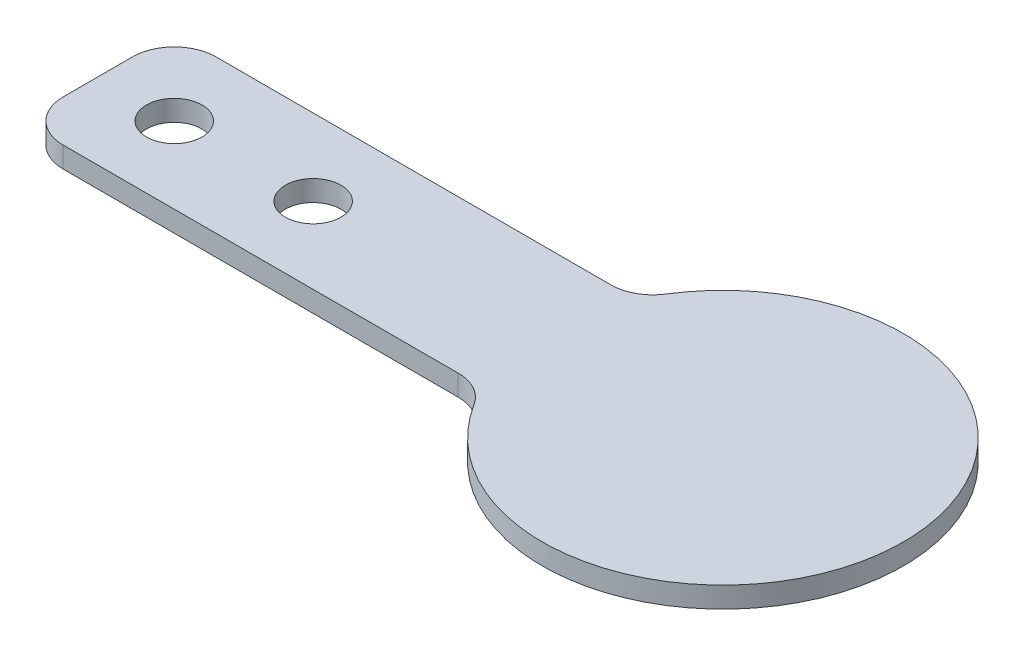
ISO-10303-21;
HEADER;
FILE_DESCRIPTION(('STEP AP214'),'2;1');
FILE_NAME('part.step','',(''),(''),'','','');
FILE_SCHEMA(('AUTOMOTIVE_DESIGN { 1 0 10303 214 1 1 1 1 }'));
ENDSEC;
DATA;
#1=APPLICATION_CONTEXT('core data for automotive mechanical design processes');
#2=APPLICATION_PROTOCOL_DEFINITION('international standard','automotive_design',2000,#1);
#3=PRODUCT_CONTEXT('',#1,'mechanical');
#4=PRODUCT('Part','Part','',(#3));
#5=PRODUCT_RELATED_PRODUCT_CATEGORY('part','',(#4));
#6=PRODUCT_DEFINITION_FORMATION('','',#4);
#7=PRODUCT_DEFINITION_CONTEXT('part definition',#1,'design');
#8=PRODUCT_DEFINITION('design','',#6,#7);
#9=PRODUCT_DEFINITION_SHAPE('','',#8);
#10=(LENGTH_UNIT() NAMED_UNIT(*) SI_UNIT(.MILLI.,.METRE.));
#11=(NAMED_UNIT(*) PLANE_ANGLE_UNIT() SI_UNIT($,.RADIAN.));
#12=(NAMED_UNIT(*) SI_UNIT($,.STERADIAN.) SOLID_ANGLE_UNIT());
#13=UNCERTAINTY_MEASURE_WITH_UNIT(LENGTH_MEASURE(1.E-05),#10,'distance_accuracy_value','');
#14=(GEOMETRIC_REPRESENTATION_CONTEXT(3) GLOBAL_UNCERTAINTY_ASSIGNED_CONTEXT((#13)) GLOBAL_UNIT_ASSIGNED_CONTEXT((#10,
#11,#12)) REPRESENTATION_CONTEXT('',''));
#15=CARTESIAN_POINT('',(0.,0.,0.));
#16=DIRECTION('',(0.,0.,1.));
#17=DIRECTION('',(1.,0.,0.));
#18=AXIS2_PLACEMENT_3D('',#15,#16,#17);
#19=CARTESIAN_POINT('',(3.,1.5,8.));
#20=DIRECTION('',(0.,1.,0.));
#21=DIRECTION('',(0.,0.,1.));
#22=AXIS2_PLACEMENT_3D('',#19,#20,#21);
#23=PLANE('',#22);
#24=CARTESIAN_POINT('',(5.5,1.5,5.5));
#25=DIRECTION('',(0.,1.,0.));
#26=DIRECTION('',(0.,0.,1.));
#27=AXIS2_PLACEMENT_3D('',#24,#25,#26);
#28=CIRCLE('',#27,2.);
#29=CARTESIAN_POINT('',(5.5,1.5,7.5));
#30=VERTEX_POINT('',#29);
#31=EDGE_CURVE('E134',#30,#30,#28,.T.);
#32=ORIENTED_EDGE('',*,*,#31,.F.);
#33=EDGE_LOOP('',(#32));
#34=FACE_BOUND('',#33,.T.);
#35=CARTESIAN_POINT('',(3.,1.5,8.));
#36=DIRECTION('',(0.,1.,0.));
#37=DIRECTION('',(0.,0.,1.));
#38=AXIS2_PLACEMENT_3D('',#35,#36,#37);
#39=CIRCLE('',#38,3.);
#40=CARTESIAN_POINT('',(0.,1.5,7.99999999999998));
#41=VERTEX_POINT('',#40);
#42=CARTESIAN_POINT('',(3.00000000000002,1.5,11.));
#43=VERTEX_POINT('',#42);
#44=EDGE_CURVE('E145',#41,#43,#39,.T.);
#45=ORIENTED_EDGE('',*,*,#44,.T.);
#46=DIRECTION('',(1.,0.,0.));
#47=VECTOR('',#46,1.);
#48=CARTESIAN_POINT('',(3.00000000000002,1.5,11.));
#49=LINE('',#48,#47);
#50=CARTESIAN_POINT('',(31.444558288274,1.5,11.));
#51=VERTEX_POINT('',#50);
#52=EDGE_CURVE('E93',#43,#51,#49,.T.);
#53=ORIENTED_EDGE('',*,*,#52,.T.);
#54=CARTESIAN_POINT('',(31.444558288274,1.5,14.));
#55=DIRECTION('',(0.,-1.,0.));
#56=DIRECTION('',(0.,0.,-1.));
#57=AXIS2_PLACEMENT_3D('',#54,#55,#56);
#58=CIRCLE('',#57,3.);
#59=CARTESIAN_POINT('',(33.9862036092226,1.5,12.40625));
#60=VERTEX_POINT('',#59);
#61=EDGE_CURVE('E160',#51,#60,#58,.T.);
#62=ORIENTED_EDGE('',*,*,#61,.T.);
#63=CARTESIAN_POINT('',(45.,1.5,5.49999999999999));
#64=DIRECTION('',(0.,1.,0.));
#65=DIRECTION('',(0.,0.,1.));
#66=AXIS2_PLACEMENT_3D('',#63,#64,#65);
#67=CIRCLE('',#66,13.);
#68=CARTESIAN_POINT('',(33.9862036092227,1.5,-1.40625000000001));
#69=VERTEX_POINT('',#68);
#70=EDGE_CURVE('E173',#60,#69,#67,.T.);
#71=ORIENTED_EDGE('',*,*,#70,.T.);
#72=CARTESIAN_POINT('',(31.444558288274,1.5,-3.00000000000001));
#73=DIRECTION('',(0.,-1.,0.));
#74=DIRECTION('',(0.,0.,1.));
#75=AXIS2_PLACEMENT_3D('',#72,#73,#74);
#76=CIRCLE('',#75,3.);
#77=CARTESIAN_POINT('',(31.444558288274,1.5,0.));
#78=VERTEX_POINT('',#77);
#79=EDGE_CURVE('E112',#69,#78,#76,.T.);
#80=ORIENTED_EDGE('',*,*,#79,.T.);
#81=DIRECTION('',(-1.,0.,0.));
#82=VECTOR('',#81,1.);
#83=CARTESIAN_POINT('',(3.00000000000002,1.5,0.));
#84=LINE('',#83,#82);
#85=CARTESIAN_POINT('',(3.00000000000002,1.5,0.));
#86=VERTEX_POINT('',#85);
#87=EDGE_CURVE('E106',#78,#86,#84,.T.);
#88=ORIENTED_EDGE('',*,*,#87,.T.);
#89=CARTESIAN_POINT('',(3.,1.5,3.));
#90=DIRECTION('',(0.,1.,0.));
#91=DIRECTION('',(0.,0.,1.));
#92=AXIS2_PLACEMENT_3D('',#89,#90,#91);
#93=CIRCLE('',#92,3.);
#94=CARTESIAN_POINT('',(0.,1.5,3.00000000000002));
#95=VERTEX_POINT('',#94);
#96=EDGE_CURVE('E110',#86,#95,#93,.T.);
#97=ORIENTED_EDGE('',*,*,#96,.T.);
#98=DIRECTION('',(0.,0.,1.));
#99=VECTOR('',#98,1.);
#100=CARTESIAN_POINT('',(0.,1.5,3.00000000000002));
#101=LINE('',#100,#99);
#102=EDGE_CURVE('E50',#95,#41,#101,.T.);
#103=ORIENTED_EDGE('',*,*,#102,.T.);
#104=EDGE_LOOP('',(#45,#53,#62,#71,#80,#88,#97,#103));
#105=FACE_BOUND('',#104,.T.);
#106=CARTESIAN_POINT('',(15.5,1.5,5.5));
#107=DIRECTION('',(0.,1.,0.));
#108=DIRECTION('',(0.,0.,1.));
#109=AXIS2_PLACEMENT_3D('',#106,#107,#108);
#110=CIRCLE('',#109,2.);
#111=CARTESIAN_POINT('',(15.5,1.5,7.5));
#112=VERTEX_POINT('',#111);
#113=EDGE_CURVE('E182',#112,#112,#110,.T.);
#114=ORIENTED_EDGE('',*,*,#113,.F.);
#115=EDGE_LOOP('',(#114));
#116=FACE_BOUND('',#115,.T.);
#117=ADVANCED_FACE('F33',(#34,#105,#116),#23,.T.);
#118=CARTESIAN_POINT('',(3.,0.,8.));
#119=DIRECTION('',(0.,1.,0.));
#120=DIRECTION('',(0.,0.,1.));
#121=AXIS2_PLACEMENT_3D('',#118,#119,#120);
#122=PLANE('',#121);
#123=CARTESIAN_POINT('',(5.5,0.,5.5));
#124=DIRECTION('',(0.,1.,0.));
#125=DIRECTION('',(0.,0.,1.));
#126=AXIS2_PLACEMENT_3D('',#123,#124,#125);
#127=CIRCLE('',#126,2.);
#128=CARTESIAN_POINT('',(5.5,0.,7.5));
#129=VERTEX_POINT('',#128);
#130=EDGE_CURVE('E179',#129,#129,#127,.T.);
#131=ORIENTED_EDGE('',*,*,#130,.T.);
#132=EDGE_LOOP('',(#131));
#133=FACE_BOUND('',#132,.T.);
#134=CARTESIAN_POINT('',(3.,0.,8.));
#135=DIRECTION('',(0.,1.,0.));
#136=DIRECTION('',(0.,0.,1.));
#137=AXIS2_PLACEMENT_3D('',#134,#135,#136);
#138=CIRCLE('',#137,3.);
#139=CARTESIAN_POINT('',(0.,0.,7.99999999999998));
#140=VERTEX_POINT('',#139);
#141=CARTESIAN_POINT('',(3.00000000000002,0.,11.));
#142=VERTEX_POINT('',#141);
#143=EDGE_CURVE('E130',#140,#142,#138,.T.);
#144=ORIENTED_EDGE('',*,*,#143,.F.);
#145=DIRECTION('',(0.,0.,1.));
#146=VECTOR('',#145,1.);
#147=CARTESIAN_POINT('',(0.,0.,3.00000000000002));
#148=LINE('',#147,#146);
#149=CARTESIAN_POINT('',(0.,0.,3.00000000000002));
#150=VERTEX_POINT('',#149);
#151=EDGE_CURVE('E85',#150,#140,#148,.T.);
#152=ORIENTED_EDGE('',*,*,#151,.F.);
#153=CARTESIAN_POINT('',(3.,0.,3.));
#154=DIRECTION('',(0.,1.,0.));
#155=DIRECTION('',(0.,0.,1.));
#156=AXIS2_PLACEMENT_3D('',#153,#154,#155);
#157=CIRCLE('',#156,3.);
#158=CARTESIAN_POINT('',(3.00000000000002,0.,0.));
#159=VERTEX_POINT('',#158);
#160=EDGE_CURVE('E79',#159,#150,#157,.T.);
#161=ORIENTED_EDGE('',*,*,#160,.F.);
#162=DIRECTION('',(-1.,0.,0.));
#163=VECTOR('',#162,1.);
#164=CARTESIAN_POINT('',(3.00000000000002,0.,0.));
#165=LINE('',#164,#163);
#166=CARTESIAN_POINT('',(31.444558288274,0.,0.));
#167=VERTEX_POINT('',#166);
#168=EDGE_CURVE('E120',#167,#159,#165,.T.);
#169=ORIENTED_EDGE('',*,*,#168,.F.);
#170=CARTESIAN_POINT('',(31.444558288274,0.,-3.00000000000001));
#171=DIRECTION('',(0.,-1.,0.));
#172=DIRECTION('',(0.,0.,1.));
#173=AXIS2_PLACEMENT_3D('',#170,#171,#172);
#174=CIRCLE('',#173,3.);
#175=CARTESIAN_POINT('',(33.9862036092227,0.,-1.40625000000001));
#176=VERTEX_POINT('',#175);
#177=EDGE_CURVE('E140',#176,#167,#174,.T.);
#178=ORIENTED_EDGE('',*,*,#177,.F.);
#179=CARTESIAN_POINT('',(45.,0.,5.49999999999999));
#180=DIRECTION('',(0.,1.,0.));
#181=DIRECTION('',(0.,0.,1.));
#182=AXIS2_PLACEMENT_3D('',#179,#180,#181);
#183=CIRCLE('',#182,13.);
#184=CARTESIAN_POINT('',(33.9862036092226,0.,12.40625));
#185=VERTEX_POINT('',#184);
#186=EDGE_CURVE('E138',#185,#176,#183,.T.);
#187=ORIENTED_EDGE('',*,*,#186,.F.);
#188=CARTESIAN_POINT('',(31.444558288274,0.,14.));
#189=DIRECTION('',(0.,-1.,0.));
#190=DIRECTION('',(0.,0.,-1.));
#191=AXIS2_PLACEMENT_3D('',#188,#189,#190);
#192=CIRCLE('',#191,3.);
#193=CARTESIAN_POINT('',(31.444558288274,0.,11.));
#194=VERTEX_POINT('',#193);
#195=EDGE_CURVE('E136',#194,#185,#192,.T.);
#196=ORIENTED_EDGE('',*,*,#195,.F.);
#197=DIRECTION('',(1.,0.,0.));
#198=VECTOR('',#197,1.);
#199=CARTESIAN_POINT('',(3.00000000000002,0.,11.));
#200=LINE('',#199,#198);
#201=EDGE_CURVE('E133',#142,#194,#200,.T.);
#202=ORIENTED_EDGE('',*,*,#201,.F.);
#203=EDGE_LOOP('',(#144,#152,#161,#169,#178,#187,#196,#202));
#204=FACE_BOUND('',#203,.T.);
#205=CARTESIAN_POINT('',(15.5,0.,5.5));
#206=DIRECTION('',(0.,1.,0.));
#207=DIRECTION('',(0.,0.,1.));
#208=AXIS2_PLACEMENT_3D('',#205,#206,#207);
#209=CIRCLE('',#208,2.);
#210=CARTESIAN_POINT('',(15.5,0.,7.5));
#211=VERTEX_POINT('',#210);
#212=EDGE_CURVE('E185',#211,#211,#209,.T.);
#213=ORIENTED_EDGE('',*,*,#212,.T.);
#214=EDGE_LOOP('',(#213));
#215=FACE_BOUND('',#214,.T.);
#216=ADVANCED_FACE('F164',(#133,#204,#215),#122,.F.);
#217=CARTESIAN_POINT('',(3.,1.5,8.));
#218=DIRECTION('',(0.,-1.,0.));
#219=DIRECTION('',(0.,0.,-1.));
#220=AXIS2_PLACEMENT_3D('',#217,#218,#219);
#221=CYLINDRICAL_SURFACE('',#220,3.);
#222=ORIENTED_EDGE('',*,*,#143,.T.);
#223=DIRECTION('',(0.,-1.,0.));
#224=VECTOR('',#223,1.);
#225=CARTESIAN_POINT('',(3.00000000000002,1.5,11.));
#226=LINE('',#225,#224);
#227=EDGE_CURVE('E11',#43,#142,#226,.T.);
#228=ORIENTED_EDGE('',*,*,#227,.F.);
#229=ORIENTED_EDGE('',*,*,#44,.F.);
#230=DIRECTION('',(0.,-1.,0.));
#231=VECTOR('',#230,1.);
#232=CARTESIAN_POINT('',(0.,1.5,7.99999999999998));
#233=LINE('',#232,#231);
#234=EDGE_CURVE('E126',#41,#140,#233,.T.);
#235=ORIENTED_EDGE('',*,*,#234,.T.);
#236=EDGE_LOOP('',(#222,#228,#229,#235));
#237=FACE_BOUND('',#236,.T.);
#238=ADVANCED_FACE('F35',(#237),#221,.T.);
#239=CARTESIAN_POINT('',(3.00000000000002,1.5,11.));
#240=DIRECTION('',(0.,0.,-1.));
#241=DIRECTION('',(-1.,0.,0.));
#242=AXIS2_PLACEMENT_3D('',#239,#240,#241);
#243=PLANE('',#242);
#244=ORIENTED_EDGE('',*,*,#201,.T.);
#245=DIRECTION('',(0.,-1.,0.));
#246=VECTOR('',#245,1.);
#247=CARTESIAN_POINT('',(31.444558288274,1.5,11.));
#248=LINE('',#247,#246);
#249=EDGE_CURVE('E42',#51,#194,#248,.T.);
#250=ORIENTED_EDGE('',*,*,#249,.F.);
#251=ORIENTED_EDGE('',*,*,#52,.F.);
#252=ORIENTED_EDGE('',*,*,#227,.T.);
#253=EDGE_LOOP('',(#244,#250,#251,#252));
#254=FACE_BOUND('',#253,.T.);
#255=ADVANCED_FACE('F218',(#254),#243,.F.);
#256=CARTESIAN_POINT('',(31.444558288274,1.5,14.));
#257=DIRECTION('',(0.,-1.,0.));
#258=DIRECTION('',(0.,0.,-1.));
#259=AXIS2_PLACEMENT_3D('',#256,#257,#258);
#260=CYLINDRICAL_SURFACE('',#259,3.);
#261=ORIENTED_EDGE('',*,*,#195,.T.);
#262=DIRECTION('',(0.,-1.,0.));
#263=VECTOR('',#262,1.);
#264=CARTESIAN_POINT('',(33.9862036092226,1.5,12.40625));
#265=LINE('',#264,#263);
#266=EDGE_CURVE('E152',#60,#185,#265,.T.);
#267=ORIENTED_EDGE('',*,*,#266,.F.);
#268=ORIENTED_EDGE('',*,*,#61,.F.);
#269=ORIENTED_EDGE('',*,*,#249,.T.);
#270=EDGE_LOOP('',(#261,#267,#268,#269));
#271=FACE_BOUND('',#270,.T.);
#272=ADVANCED_FACE('F158',(#271),#260,.F.);
#273=CARTESIAN_POINT('',(45.,1.5,5.49999999999999));
#274=DIRECTION('',(0.,-1.,0.));
#275=DIRECTION('',(0.,0.,-1.));
#276=AXIS2_PLACEMENT_3D('',#273,#274,#275);
#277=CYLINDRICAL_SURFACE('',#276,13.);
#278=ORIENTED_EDGE('',*,*,#186,.T.);
#279=DIRECTION('',(0.,-1.,0.));
#280=VECTOR('',#279,1.);
#281=CARTESIAN_POINT('',(33.9862036092227,1.5,-1.40625000000001));
#282=LINE('',#281,#280);
#283=EDGE_CURVE('E149',#69,#176,#282,.T.);
#284=ORIENTED_EDGE('',*,*,#283,.F.);
#285=ORIENTED_EDGE('',*,*,#70,.F.);
#286=ORIENTED_EDGE('',*,*,#266,.T.);
#287=EDGE_LOOP('',(#278,#284,#285,#286));
#288=FACE_BOUND('',#287,.T.);
#289=ADVANCED_FACE('F169',(#288),#277,.T.);
#290=CARTESIAN_POINT('',(31.444558288274,1.5,-3.00000000000001));
#291=DIRECTION('',(0.,-1.,0.));
#292=DIRECTION('',(0.,0.,-1.));
#293=AXIS2_PLACEMENT_3D('',#290,#291,#292);
#294=CYLINDRICAL_SURFACE('',#293,3.);
#295=ORIENTED_EDGE('',*,*,#177,.T.);
#296=DIRECTION('',(0.,-1.,0.));
#297=VECTOR('',#296,1.);
#298=CARTESIAN_POINT('',(31.444558288274,1.5,0.));
#299=LINE('',#298,#297);
#300=EDGE_CURVE('E121',#78,#167,#299,.T.);
#301=ORIENTED_EDGE('',*,*,#300,.F.);
#302=ORIENTED_EDGE('',*,*,#79,.F.);
#303=ORIENTED_EDGE('',*,*,#283,.T.);
#304=EDGE_LOOP('',(#295,#301,#302,#303));
#305=FACE_BOUND('',#304,.T.);
#306=ADVANCED_FACE('F172',(#305),#294,.F.);
#307=CARTESIAN_POINT('',(3.00000000000002,1.5,0.));
#308=DIRECTION('',(0.,0.,1.));
#309=DIRECTION('',(1.,0.,0.));
#310=AXIS2_PLACEMENT_3D('',#307,#308,#309);
#311=PLANE('',#310);
#312=ORIENTED_EDGE('',*,*,#168,.T.);
#313=DIRECTION('',(0.,-1.,0.));
#314=VECTOR('',#313,1.);
#315=CARTESIAN_POINT('',(3.00000000000002,1.5,0.));
#316=LINE('',#315,#314);
#317=EDGE_CURVE('E117',#86,#159,#316,.T.);
#318=ORIENTED_EDGE('',*,*,#317,.F.);
#319=ORIENTED_EDGE('',*,*,#87,.F.);
#320=ORIENTED_EDGE('',*,*,#300,.T.);
#321=EDGE_LOOP('',(#312,#318,#319,#320));
#322=FACE_BOUND('',#321,.T.);
#323=ADVANCED_FACE('F118',(#322),#311,.F.);
#324=CARTESIAN_POINT('',(3.,1.5,3.));
#325=DIRECTION('',(0.,-1.,0.));
#326=DIRECTION('',(0.,0.,-1.));
#327=AXIS2_PLACEMENT_3D('',#324,#325,#326);
#328=CYLINDRICAL_SURFACE('',#327,3.);
#329=ORIENTED_EDGE('',*,*,#160,.T.);
#330=DIRECTION('',(0.,-1.,0.));
#331=VECTOR('',#330,1.);
#332=CARTESIAN_POINT('',(0.,1.5,3.00000000000002));
#333=LINE('',#332,#331);
#334=EDGE_CURVE('E122',#95,#150,#333,.T.);
#335=ORIENTED_EDGE('',*,*,#334,.F.);
#336=ORIENTED_EDGE('',*,*,#96,.F.);
#337=ORIENTED_EDGE('',*,*,#317,.T.);
#338=EDGE_LOOP('',(#329,#335,#336,#337));
#339=FACE_BOUND('',#338,.T.);
#340=ADVANCED_FACE('F124',(#339),#328,.T.);
#341=CARTESIAN_POINT('',(0.,1.5,3.00000000000002));
#342=DIRECTION('',(1.,0.,0.));
#343=DIRECTION('',(0.,0.,-1.));
#344=AXIS2_PLACEMENT_3D('',#341,#342,#343);
#345=PLANE('',#344);
#346=ORIENTED_EDGE('',*,*,#151,.T.);
#347=ORIENTED_EDGE('',*,*,#234,.F.);
#348=ORIENTED_EDGE('',*,*,#102,.F.);
#349=ORIENTED_EDGE('',*,*,#334,.T.);
#350=EDGE_LOOP('',(#346,#347,#348,#349));
#351=FACE_BOUND('',#350,.T.);
#352=ADVANCED_FACE('F206',(#351),#345,.F.);
#353=CARTESIAN_POINT('',(5.5,1.5,5.5));
#354=DIRECTION('',(0.,-1.,0.));
#355=DIRECTION('',(0.,0.,-1.));
#356=AXIS2_PLACEMENT_3D('',#353,#354,#355);
#357=CYLINDRICAL_SURFACE('',#356,2.);
#358=ORIENTED_EDGE('',*,*,#31,.T.);
#359=EDGE_LOOP('',(#358));
#360=FACE_BOUND('',#359,.T.);
#361=ORIENTED_EDGE('',*,*,#130,.F.);
#362=EDGE_LOOP('',(#361));
#363=FACE_BOUND('',#362,.T.);
#364=ADVANCED_FACE('F203',(#360,#363),#357,.F.);
#365=CARTESIAN_POINT('',(15.5,1.5,5.5));
#366=DIRECTION('',(0.,-1.,0.));
#367=DIRECTION('',(0.,0.,-1.));
#368=AXIS2_PLACEMENT_3D('',#365,#366,#367);
#369=CYLINDRICAL_SURFACE('',#368,2.);
#370=ORIENTED_EDGE('',*,*,#113,.T.);
#371=EDGE_LOOP('',(#370));
#372=FACE_BOUND('',#371,.T.);
#373=ORIENTED_EDGE('',*,*,#212,.F.);
#374=EDGE_LOOP('',(#373));
#375=FACE_BOUND('',#374,.T.);
#376=ADVANCED_FACE('F191',(#372,#375),#369,.F.);
#377=CLOSED_SHELL('',(#117,#216,#238,#255,#272,#289,#306,#323,#340,#352,#364,#376));
#378=MANIFOLD_SOLID_BREP('B2',#377);
#379=ADVANCED_BREP_SHAPE_REPRESENTATION('',(#18,#378),#14);
#380=SHAPE_DEFINITION_REPRESENTATION(#9,#379);
ENDSEC;
END-ISO-10303-21;
